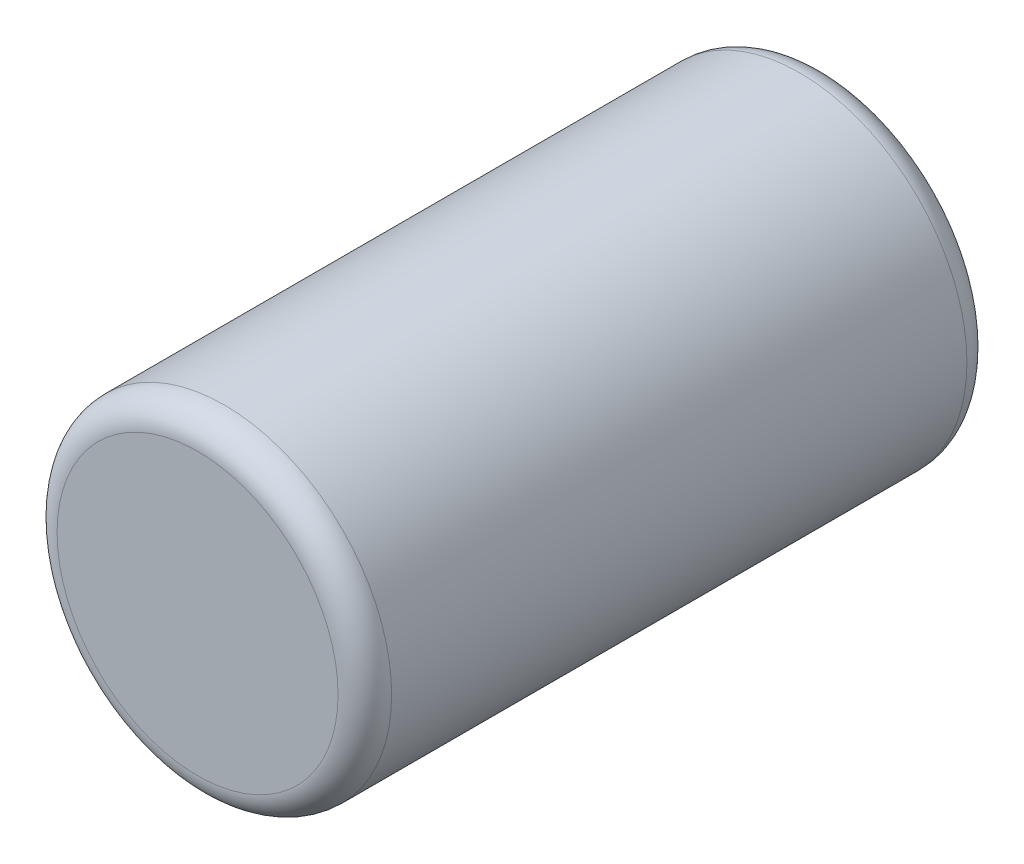
ISO-10303-21;
HEADER;
FILE_DESCRIPTION(('STEP AP214'),'2;1');
FILE_NAME('part.step','',(''),(''),'','','');
FILE_SCHEMA(('AUTOMOTIVE_DESIGN { 1 0 10303 214 1 1 1 1 }'));
ENDSEC;
DATA;
#1=APPLICATION_CONTEXT('core data for automotive mechanical design processes');
#2=APPLICATION_PROTOCOL_DEFINITION('international standard','automotive_design',2000,#1);
#3=PRODUCT_CONTEXT('',#1,'mechanical');
#4=PRODUCT('Part','Part','',(#3));
#5=PRODUCT_RELATED_PRODUCT_CATEGORY('part','',(#4));
#6=PRODUCT_DEFINITION_FORMATION('','',#4);
#7=PRODUCT_DEFINITION_CONTEXT('part definition',#1,'design');
#8=PRODUCT_DEFINITION('design','',#6,#7);
#9=PRODUCT_DEFINITION_SHAPE('','',#8);
#10=(LENGTH_UNIT() NAMED_UNIT(*) SI_UNIT(.MILLI.,.METRE.));
#11=(NAMED_UNIT(*) PLANE_ANGLE_UNIT() SI_UNIT($,.RADIAN.));
#12=(NAMED_UNIT(*) SI_UNIT($,.STERADIAN.) SOLID_ANGLE_UNIT());
#13=UNCERTAINTY_MEASURE_WITH_UNIT(LENGTH_MEASURE(1.E-05),#10,'distance_accuracy_value','');
#14=(GEOMETRIC_REPRESENTATION_CONTEXT(3) GLOBAL_UNCERTAINTY_ASSIGNED_CONTEXT((#13)) GLOBAL_UNIT_ASSIGNED_CONTEXT((#10,
#11,#12)) REPRESENTATION_CONTEXT('',''));
#15=CARTESIAN_POINT('',(0.,0.,0.));
#16=DIRECTION('',(0.,0.,1.));
#17=DIRECTION('',(1.,0.,0.));
#18=AXIS2_PLACEMENT_3D('',#15,#16,#17);
#19=CARTESIAN_POINT('',(0.,0.,0.));
#20=DIRECTION('',(0.,0.,1.));
#21=DIRECTION('',(1.,0.,0.));
#22=AXIS2_PLACEMENT_3D('',#19,#20,#21);
#23=PLANE('',#22);
#24=CARTESIAN_POINT('',(0.,0.,0.));
#25=DIRECTION('',(0.,0.,-1.));
#26=DIRECTION('',(-1.,0.,0.));
#27=AXIS2_PLACEMENT_3D('',#24,#25,#26);
#28=CIRCLE('',#27,1.05);
#29=CARTESIAN_POINT('',(-1.05,0.,0.));
#30=VERTEX_POINT('',#29);
#31=EDGE_CURVE('E10',#30,#30,#28,.T.);
#32=ORIENTED_EDGE('',*,*,#31,.T.);
#33=EDGE_LOOP('',(#32));
#34=FACE_BOUND('',#33,.T.);
#35=ADVANCED_FACE('F15',(#34),#23,.F.);
#36=CARTESIAN_POINT('',(0.,0.,0.2));
#37=DIRECTION('',(0.,0.,1.));
#38=DIRECTION('',(0.999947190700851,0.0102769552629195,0.));
#39=AXIS2_PLACEMENT_3D('',#36,#37,#38);
#40=TOROIDAL_SURFACE('',#39,1.05,0.2);
#41=CARTESIAN_POINT('',(0.,0.,0.2));
#42=DIRECTION('',(0.,0.,-1.));
#43=DIRECTION('',(1.,0.,0.));
#44=AXIS2_PLACEMENT_3D('',#41,#42,#43);
#45=CIRCLE('',#44,1.25);
#46=CARTESIAN_POINT('',(1.25,0.,0.2));
#47=VERTEX_POINT('',#46);
#48=EDGE_CURVE('E23',#47,#47,#45,.T.);
#49=ORIENTED_EDGE('',*,*,#48,.T.);
#50=EDGE_LOOP('',(#49));
#51=FACE_BOUND('',#50,.T.);
#52=ORIENTED_EDGE('',*,*,#31,.F.);
#53=EDGE_LOOP('',(#52));
#54=FACE_BOUND('',#53,.T.);
#55=ADVANCED_FACE('F46',(#51,#54),#40,.T.);
#56=CARTESIAN_POINT('',(0.,0.,0.));
#57=DIRECTION('',(0.,0.,1.));
#58=DIRECTION('',(1.,0.,0.));
#59=AXIS2_PLACEMENT_3D('',#56,#57,#58);
#60=CYLINDRICAL_SURFACE('',#59,1.25);
#61=CARTESIAN_POINT('',(0.,0.,4.5));
#62=DIRECTION('',(0.,0.,1.));
#63=DIRECTION('',(1.,0.,0.));
#64=AXIS2_PLACEMENT_3D('',#61,#62,#63);
#65=CIRCLE('',#64,1.25);
#66=CARTESIAN_POINT('',(1.25,0.,4.5));
#67=VERTEX_POINT('',#66);
#68=EDGE_CURVE('E28',#67,#67,#65,.T.);
#69=ORIENTED_EDGE('',*,*,#68,.F.);
#70=EDGE_LOOP('',(#69));
#71=FACE_BOUND('',#70,.T.);
#72=ORIENTED_EDGE('',*,*,#48,.F.);
#73=EDGE_LOOP('',(#72));
#74=FACE_BOUND('',#73,.T.);
#75=ADVANCED_FACE('F39',(#71,#74),#60,.T.);
#76=CARTESIAN_POINT('',(0.,0.,4.5));
#77=DIRECTION('',(0.,0.,1.));
#78=DIRECTION('',(0.999973830475399,-0.00723452585581599,0.));
#79=AXIS2_PLACEMENT_3D('',#76,#77,#78);
#80=TOROIDAL_SURFACE('',#79,1.05,0.2);
#81=ORIENTED_EDGE('',*,*,#68,.T.);
#82=EDGE_LOOP('',(#81));
#83=FACE_BOUND('',#82,.T.);
#84=CARTESIAN_POINT('',(0.,0.,4.7));
#85=DIRECTION('',(0.,0.,1.));
#86=DIRECTION('',(1.,0.,0.));
#87=AXIS2_PLACEMENT_3D('',#84,#85,#86);
#88=CIRCLE('',#87,1.05);
#89=CARTESIAN_POINT('',(1.05,0.,4.7));
#90=VERTEX_POINT('',#89);
#91=EDGE_CURVE('E19',#90,#90,#88,.T.);
#92=ORIENTED_EDGE('',*,*,#91,.F.);
#93=EDGE_LOOP('',(#92));
#94=FACE_BOUND('',#93,.T.);
#95=ADVANCED_FACE('F37',(#83,#94),#80,.T.);
#96=CARTESIAN_POINT('',(0.,0.,4.7));
#97=DIRECTION('',(0.,0.,1.));
#98=DIRECTION('',(1.,0.,0.));
#99=AXIS2_PLACEMENT_3D('',#96,#97,#98);
#100=PLANE('',#99);
#101=ORIENTED_EDGE('',*,*,#91,.T.);
#102=EDGE_LOOP('',(#101));
#103=FACE_BOUND('',#102,.T.);
#104=ADVANCED_FACE('F17',(#103),#100,.T.);
#105=CLOSED_SHELL('',(#35,#55,#75,#95,#104));
#106=MANIFOLD_SOLID_BREP('B1',#105);
#107=ADVANCED_BREP_SHAPE_REPRESENTATION('',(#18,#106),#14);
#108=SHAPE_DEFINITION_REPRESENTATION(#9,#107);
ENDSEC;
END-ISO-10303-21;
